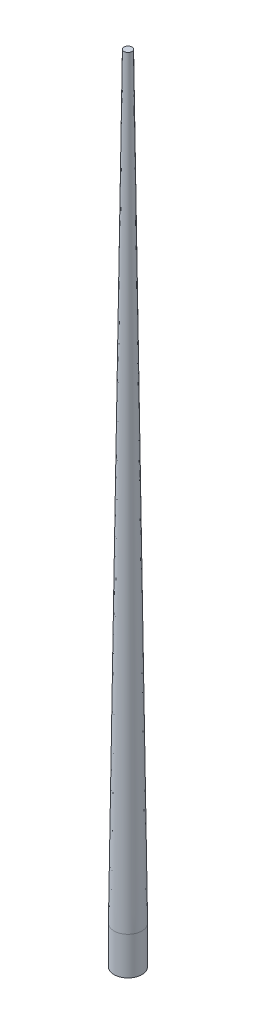
ISO-10303-21;
HEADER;
FILE_DESCRIPTION(('STEP AP214'),'2;1');
FILE_NAME('part.step','',(''),(''),'','','');
FILE_SCHEMA(('AUTOMOTIVE_DESIGN { 1 0 10303 214 1 1 1 1 }'));
ENDSEC;
DATA;
#1=APPLICATION_CONTEXT('core data for automotive mechanical design processes');
#2=APPLICATION_PROTOCOL_DEFINITION('international standard','automotive_design',2000,#1);
#3=PRODUCT_CONTEXT('',#1,'mechanical');
#4=PRODUCT('Part','Part','',(#3));
#5=PRODUCT_RELATED_PRODUCT_CATEGORY('part','',(#4));
#6=PRODUCT_DEFINITION_FORMATION('','',#4);
#7=PRODUCT_DEFINITION_CONTEXT('part definition',#1,'design');
#8=PRODUCT_DEFINITION('design','',#6,#7);
#9=PRODUCT_DEFINITION_SHAPE('','',#8);
#10=(LENGTH_UNIT() NAMED_UNIT(*) SI_UNIT(.MILLI.,.METRE.));
#11=(NAMED_UNIT(*) PLANE_ANGLE_UNIT() SI_UNIT($,.RADIAN.));
#12=(NAMED_UNIT(*) SI_UNIT($,.STERADIAN.) SOLID_ANGLE_UNIT());
#13=UNCERTAINTY_MEASURE_WITH_UNIT(LENGTH_MEASURE(1.E-05),#10,'distance_accuracy_value','');
#14=(GEOMETRIC_REPRESENTATION_CONTEXT(3) GLOBAL_UNCERTAINTY_ASSIGNED_CONTEXT((#13)) GLOBAL_UNIT_ASSIGNED_CONTEXT((#10,
#11,#12)) REPRESENTATION_CONTEXT('',''));
#15=CARTESIAN_POINT('',(0.,0.,0.));
#16=DIRECTION('',(0.,0.,1.));
#17=DIRECTION('',(1.,0.,0.));
#18=AXIS2_PLACEMENT_3D('',#15,#16,#17);
#19=CARTESIAN_POINT('',(0.,-30.,0.));
#20=DIRECTION('',(0.,1.,0.));
#21=DIRECTION('',(0.,0.,1.));
#22=AXIS2_PLACEMENT_3D('',#19,#20,#21);
#23=CYLINDRICAL_SURFACE('',#22,11.);
#24=CARTESIAN_POINT('',(0.,-30.,0.));
#25=DIRECTION('',(0.,1.,0.));
#26=DIRECTION('',(0.,0.,1.));
#27=AXIS2_PLACEMENT_3D('',#24,#25,#26);
#28=CIRCLE('',#27,11.);
#29=CARTESIAN_POINT('',(0.,-30.,11.));
#30=VERTEX_POINT('',#29);
#31=EDGE_CURVE('E10',#30,#30,#28,.T.);
#32=ORIENTED_EDGE('',*,*,#31,.T.);
#33=EDGE_LOOP('',(#32));
#34=FACE_BOUND('',#33,.T.);
#35=CARTESIAN_POINT('',(0.,0.,0.));
#36=DIRECTION('',(0.,1.,0.));
#37=DIRECTION('',(0.,0.,1.));
#38=AXIS2_PLACEMENT_3D('',#35,#36,#37);
#39=CIRCLE('',#38,11.);
#40=CARTESIAN_POINT('',(0.,0.,11.));
#41=VERTEX_POINT('',#40);
#42=EDGE_CURVE('E34',#41,#41,#39,.T.);
#43=ORIENTED_EDGE('',*,*,#42,.F.);
#44=EDGE_LOOP('',(#43));
#45=FACE_BOUND('',#44,.T.);
#46=ADVANCED_FACE('F31',(#34,#45),#23,.T.);
#47=CARTESIAN_POINT('',(0.,-30.,0.));
#48=DIRECTION('',(0.,1.,0.));
#49=DIRECTION('',(0.,0.,1.));
#50=AXIS2_PLACEMENT_3D('',#47,#48,#49);
#51=PLANE('',#50);
#52=ORIENTED_EDGE('',*,*,#31,.F.);
#53=EDGE_LOOP('',(#52));
#54=FACE_BOUND('',#53,.T.);
#55=ADVANCED_FACE('F51',(#54),#51,.F.);
#56=CARTESIAN_POINT('',(0.,0.,0.));
#57=DIRECTION('',(0.,-1.,0.));
#58=DIRECTION('',(0.,0.,1.));
#59=AXIS2_PLACEMENT_3D('',#56,#57,#58);
#60=CONICAL_SURFACE('',#59,11.,0.0130899693899575);
#61=CARTESIAN_POINT('',(0.,600.,0.));
#62=DIRECTION('',(0.,1.,0.));
#63=DIRECTION('',(0.,0.,1.));
#64=AXIS2_PLACEMENT_3D('',#61,#62,#63);
#65=CIRCLE('',#64,3.14556974909893);
#66=CARTESIAN_POINT('',(0.,600.,3.14556974909893));
#67=VERTEX_POINT('',#66);
#68=EDGE_CURVE('E41',#67,#67,#65,.T.);
#69=ORIENTED_EDGE('',*,*,#68,.F.);
#70=EDGE_LOOP('',(#69));
#71=FACE_BOUND('',#70,.T.);
#72=ORIENTED_EDGE('',*,*,#42,.T.);
#73=EDGE_LOOP('',(#72));
#74=FACE_BOUND('',#73,.T.);
#75=ADVANCED_FACE('F48',(#71,#74),#60,.T.);
#76=CARTESIAN_POINT('',(0.,600.,0.));
#77=DIRECTION('',(0.,1.,0.));
#78=DIRECTION('',(0.,0.,1.));
#79=AXIS2_PLACEMENT_3D('',#76,#77,#78);
#80=PLANE('',#79);
#81=ORIENTED_EDGE('',*,*,#68,.T.);
#82=EDGE_LOOP('',(#81));
#83=FACE_BOUND('',#82,.T.);
#84=ADVANCED_FACE('F46',(#83),#80,.T.);
#85=CLOSED_SHELL('',(#46,#55,#75,#84));
#86=MANIFOLD_SOLID_BREP('B2',#85);
#87=ADVANCED_BREP_SHAPE_REPRESENTATION('',(#18,#86),#14);
#88=SHAPE_DEFINITION_REPRESENTATION(#9,#87);
ENDSEC;
END-ISO-10303-21;
